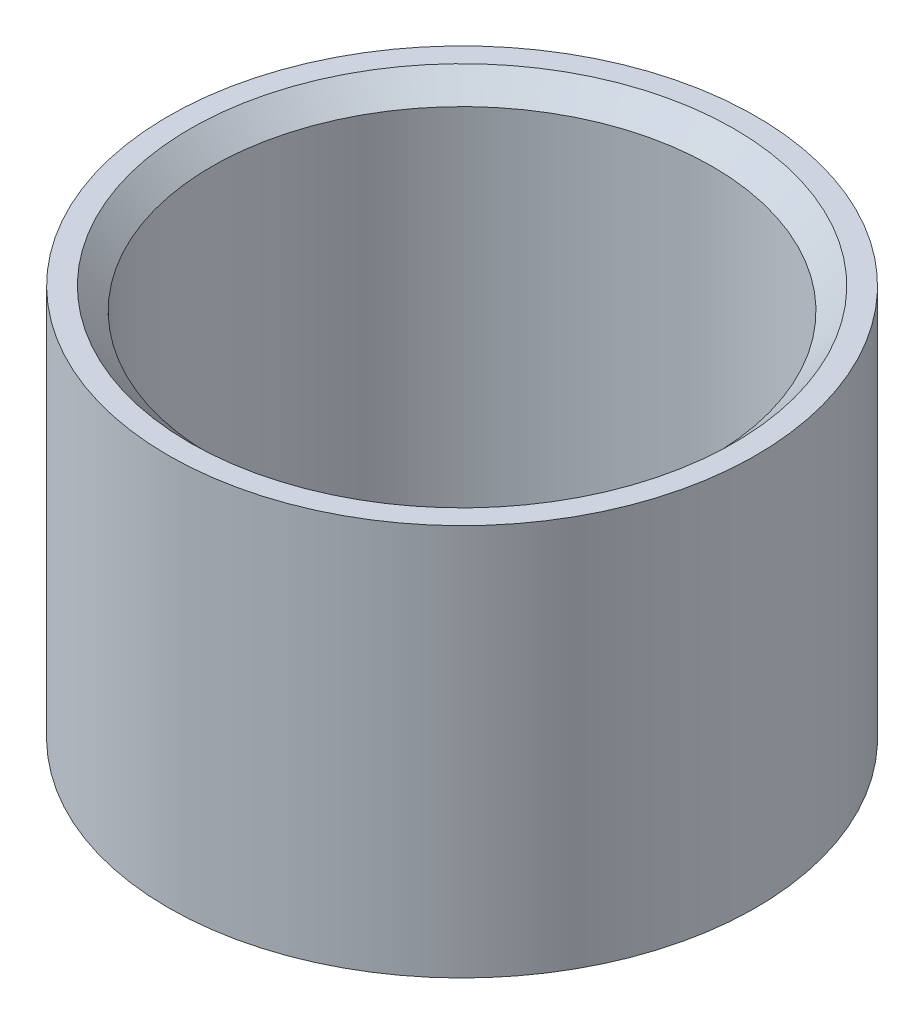
ISO-10303-21;
HEADER;
FILE_DESCRIPTION(('STEP AP214'),'2;1');
FILE_NAME('part.step','',(''),(''),'','','');
FILE_SCHEMA(('AUTOMOTIVE_DESIGN { 1 0 10303 214 1 1 1 1 }'));
ENDSEC;
DATA;
#1=APPLICATION_CONTEXT('core data for automotive mechanical design processes');
#2=APPLICATION_PROTOCOL_DEFINITION('international standard','automotive_design',2000,#1);
#3=PRODUCT_CONTEXT('',#1,'mechanical');
#4=PRODUCT('Part','Part','',(#3));
#5=PRODUCT_RELATED_PRODUCT_CATEGORY('part','',(#4));
#6=PRODUCT_DEFINITION_FORMATION('','',#4);
#7=PRODUCT_DEFINITION_CONTEXT('part definition',#1,'design');
#8=PRODUCT_DEFINITION('design','',#6,#7);
#9=PRODUCT_DEFINITION_SHAPE('','',#8);
#10=(LENGTH_UNIT() NAMED_UNIT(*) SI_UNIT(.MILLI.,.METRE.));
#11=(NAMED_UNIT(*) PLANE_ANGLE_UNIT() SI_UNIT($,.RADIAN.));
#12=(NAMED_UNIT(*) SI_UNIT($,.STERADIAN.) SOLID_ANGLE_UNIT());
#13=UNCERTAINTY_MEASURE_WITH_UNIT(LENGTH_MEASURE(1.E-05),#10,'distance_accuracy_value','');
#14=(GEOMETRIC_REPRESENTATION_CONTEXT(3) GLOBAL_UNCERTAINTY_ASSIGNED_CONTEXT((#13)) GLOBAL_UNIT_ASSIGNED_CONTEXT((#10,
#11,#12)) REPRESENTATION_CONTEXT('',''));
#15=CARTESIAN_POINT('',(0.,0.,0.));
#16=DIRECTION('',(0.,0.,1.));
#17=DIRECTION('',(1.,0.,0.));
#18=AXIS2_PLACEMENT_3D('',#15,#16,#17);
#19=CARTESIAN_POINT('',(0.,1.8,0.));
#20=DIRECTION('',(0.,-1.,0.));
#21=DIRECTION('',(0.,0.,-1.));
#22=AXIS2_PLACEMENT_3D('',#19,#20,#21);
#23=CYLINDRICAL_SURFACE('',#22,1.35);
#24=CARTESIAN_POINT('',(0.,1.8,0.));
#25=DIRECTION('',(0.,1.,0.));
#26=DIRECTION('',(0.,0.,1.));
#27=AXIS2_PLACEMENT_3D('',#24,#25,#26);
#28=CIRCLE('',#27,1.35);
#29=CARTESIAN_POINT('',(0.,1.8,1.35));
#30=VERTEX_POINT('',#29);
#31=EDGE_CURVE('E43',#30,#30,#28,.T.);
#32=ORIENTED_EDGE('',*,*,#31,.F.);
#33=EDGE_LOOP('',(#32));
#34=FACE_BOUND('',#33,.T.);
#35=CARTESIAN_POINT('',(0.,0.,0.));
#36=DIRECTION('',(0.,1.,0.));
#37=DIRECTION('',(0.,0.,1.));
#38=AXIS2_PLACEMENT_3D('',#35,#36,#37);
#39=CIRCLE('',#38,1.35);
#40=CARTESIAN_POINT('',(0.,0.,1.35));
#41=VERTEX_POINT('',#40);
#42=EDGE_CURVE('E47',#41,#41,#39,.T.);
#43=ORIENTED_EDGE('',*,*,#42,.T.);
#44=EDGE_LOOP('',(#43));
#45=FACE_BOUND('',#44,.T.);
#46=ADVANCED_FACE('F32',(#34,#45),#23,.T.);
#47=CARTESIAN_POINT('',(0.,1.8,0.));
#48=DIRECTION('',(0.,1.,0.));
#49=DIRECTION('',(0.,0.,1.));
#50=AXIS2_PLACEMENT_3D('',#47,#48,#49);
#51=PLANE('',#50);
#52=CARTESIAN_POINT('',(0.,1.8,0.));
#53=DIRECTION('',(0.,1.,0.));
#54=DIRECTION('',(0.,0.,1.));
#55=AXIS2_PLACEMENT_3D('',#52,#53,#54);
#56=CIRCLE('',#55,1.25);
#57=CARTESIAN_POINT('',(0.,1.8,1.25));
#58=VERTEX_POINT('',#57);
#59=EDGE_CURVE('E10',#58,#58,#56,.F.);
#60=ORIENTED_EDGE('',*,*,#59,.T.);
#61=EDGE_LOOP('',(#60));
#62=FACE_BOUND('',#61,.T.);
#63=ORIENTED_EDGE('',*,*,#31,.T.);
#64=EDGE_LOOP('',(#63));
#65=FACE_BOUND('',#64,.T.);
#66=ADVANCED_FACE('F61',(#62,#65),#51,.T.);
#67=CARTESIAN_POINT('',(0.,0.,0.));
#68=DIRECTION('',(0.,1.,0.));
#69=DIRECTION('',(0.,0.,1.));
#70=AXIS2_PLACEMENT_3D('',#67,#68,#69);
#71=PLANE('',#70);
#72=CARTESIAN_POINT('',(0.,0.,0.));
#73=DIRECTION('',(0.,1.,0.));
#74=DIRECTION('',(0.,0.,1.));
#75=AXIS2_PLACEMENT_3D('',#72,#73,#74);
#76=CIRCLE('',#75,1.15);
#77=CARTESIAN_POINT('',(0.,0.,1.15));
#78=VERTEX_POINT('',#77);
#79=EDGE_CURVE('E51',#78,#78,#76,.F.);
#80=ORIENTED_EDGE('',*,*,#79,.F.);
#81=EDGE_LOOP('',(#80));
#82=FACE_BOUND('',#81,.T.);
#83=ORIENTED_EDGE('',*,*,#42,.F.);
#84=EDGE_LOOP('',(#83));
#85=FACE_BOUND('',#84,.T.);
#86=ADVANCED_FACE('F58',(#82,#85),#71,.F.);
#87=CARTESIAN_POINT('',(0.,-0.000999999999999916,0.));
#88=DIRECTION('',(0.,1.,0.));
#89=DIRECTION('',(0.,0.,1.));
#90=AXIS2_PLACEMENT_3D('',#87,#88,#89);
#91=CYLINDRICAL_SURFACE('',#90,1.15);
#92=CARTESIAN_POINT('',(0.,1.7,0.));
#93=DIRECTION('',(0.,1.,0.));
#94=DIRECTION('',(0.,0.,1.));
#95=AXIS2_PLACEMENT_3D('',#92,#93,#94);
#96=CIRCLE('',#95,1.15);
#97=CARTESIAN_POINT('',(0.,1.7,1.15));
#98=VERTEX_POINT('',#97);
#99=EDGE_CURVE('E39',#98,#98,#96,.T.);
#100=ORIENTED_EDGE('',*,*,#99,.T.);
#101=EDGE_LOOP('',(#100));
#102=FACE_BOUND('',#101,.T.);
#103=ORIENTED_EDGE('',*,*,#79,.T.);
#104=EDGE_LOOP('',(#103));
#105=FACE_BOUND('',#104,.T.);
#106=ADVANCED_FACE('F56',(#102,#105),#91,.F.);
#107=CARTESIAN_POINT('',(0.,1.7,0.));
#108=DIRECTION('',(0.,1.,0.));
#109=DIRECTION('',(0.,0.,1.));
#110=AXIS2_PLACEMENT_3D('',#107,#108,#109);
#111=CONICAL_SURFACE('',#110,1.15,0.785398163397453);
#112=ORIENTED_EDGE('',*,*,#59,.F.);
#113=EDGE_LOOP('',(#112));
#114=FACE_BOUND('',#113,.T.);
#115=ORIENTED_EDGE('',*,*,#99,.F.);
#116=EDGE_LOOP('',(#115));
#117=FACE_BOUND('',#116,.T.);
#118=ADVANCED_FACE('F34',(#114,#117),#111,.F.);
#119=CLOSED_SHELL('',(#46,#66,#86,#106,#118));
#120=MANIFOLD_SOLID_BREP('B2',#119);
#121=ADVANCED_BREP_SHAPE_REPRESENTATION('',(#18,#120),#14);
#122=SHAPE_DEFINITION_REPRESENTATION(#9,#121);
ENDSEC;
END-ISO-10303-21;
